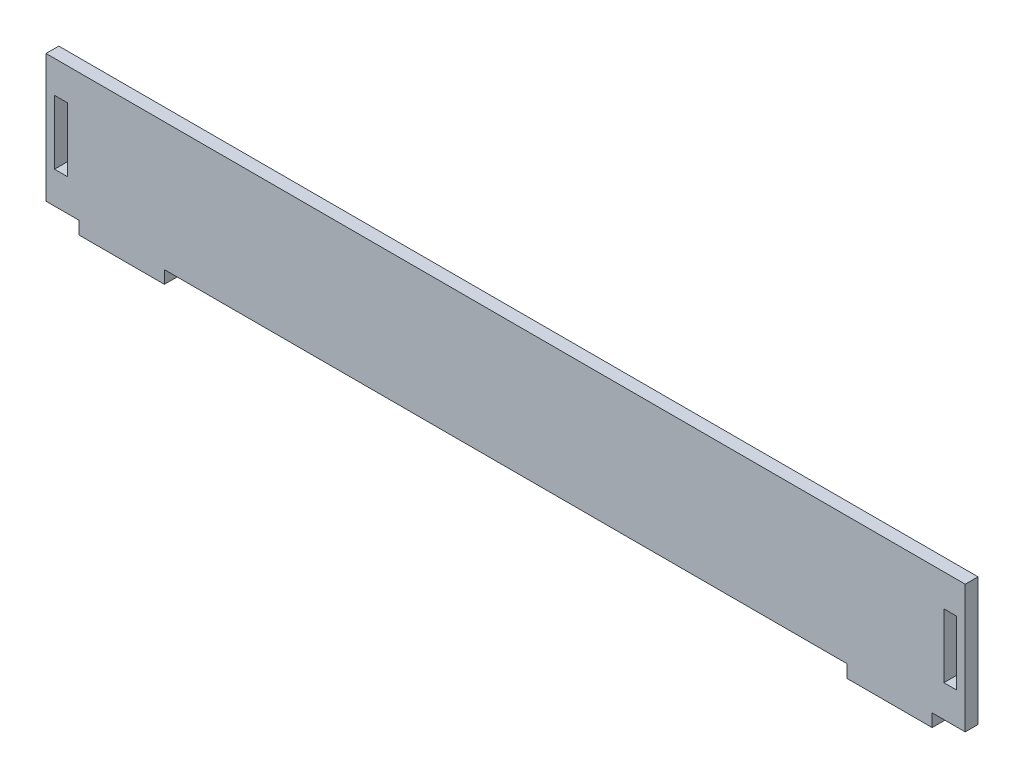
ISO-10303-21;
HEADER;
FILE_DESCRIPTION(('STEP AP214'),'2;1');
FILE_NAME('part.step','',(''),(''),'','','');
FILE_SCHEMA(('AUTOMOTIVE_DESIGN { 1 0 10303 214 1 1 1 1 }'));
ENDSEC;
DATA;
#1=APPLICATION_CONTEXT('core data for automotive mechanical design processes');
#2=APPLICATION_PROTOCOL_DEFINITION('international standard','automotive_design',2000,#1);
#3=PRODUCT_CONTEXT('',#1,'mechanical');
#4=PRODUCT('Part','Part','',(#3));
#5=PRODUCT_RELATED_PRODUCT_CATEGORY('part','',(#4));
#6=PRODUCT_DEFINITION_FORMATION('','',#4);
#7=PRODUCT_DEFINITION_CONTEXT('part definition',#1,'design');
#8=PRODUCT_DEFINITION('design','',#6,#7);
#9=PRODUCT_DEFINITION_SHAPE('','',#8);
#10=(LENGTH_UNIT() NAMED_UNIT(*) SI_UNIT(.MILLI.,.METRE.));
#11=(NAMED_UNIT(*) PLANE_ANGLE_UNIT() SI_UNIT($,.RADIAN.));
#12=(NAMED_UNIT(*) SI_UNIT($,.STERADIAN.) SOLID_ANGLE_UNIT());
#13=UNCERTAINTY_MEASURE_WITH_UNIT(LENGTH_MEASURE(1.E-05),#10,'distance_accuracy_value','');
#14=(GEOMETRIC_REPRESENTATION_CONTEXT(3) GLOBAL_UNCERTAINTY_ASSIGNED_CONTEXT((#13)) GLOBAL_UNIT_ASSIGNED_CONTEXT((#10,
#11,#12)) REPRESENTATION_CONTEXT('',''));
#15=CARTESIAN_POINT('',(0.,0.,0.));
#16=DIRECTION('',(0.,0.,1.));
#17=DIRECTION('',(1.,0.,0.));
#18=AXIS2_PLACEMENT_3D('',#15,#16,#17);
#19=CARTESIAN_POINT('',(-7.75,0.,3.));
#20=DIRECTION('',(1.,0.,0.));
#21=DIRECTION('',(0.,0.,-1.));
#22=AXIS2_PLACEMENT_3D('',#19,#20,#21);
#23=PLANE('',#22);
#24=DIRECTION('',(0.,-1.,0.));
#25=VECTOR('',#24,1.);
#26=CARTESIAN_POINT('',(-7.75,0.,0.));
#27=LINE('',#26,#25);
#28=CARTESIAN_POINT('',(-7.75,30.,0.));
#29=VERTEX_POINT('',#28);
#30=CARTESIAN_POINT('',(-7.75,0.,0.));
#31=VERTEX_POINT('',#30);
#32=EDGE_CURVE('E241',#29,#31,#27,.T.);
#33=ORIENTED_EDGE('',*,*,#32,.T.);
#34=DIRECTION('',(0.,0.,-1.));
#35=VECTOR('',#34,1.);
#36=CARTESIAN_POINT('',(-7.75,0.,3.));
#37=LINE('',#36,#35);
#38=CARTESIAN_POINT('',(-7.75,0.,3.));
#39=VERTEX_POINT('',#38);
#40=EDGE_CURVE('E193',#39,#31,#37,.T.);
#41=ORIENTED_EDGE('',*,*,#40,.F.);
#42=DIRECTION('',(0.,-1.,0.));
#43=VECTOR('',#42,1.);
#44=CARTESIAN_POINT('',(-7.75,0.,3.));
#45=LINE('',#44,#43);
#46=CARTESIAN_POINT('',(-7.75,30.,3.));
#47=VERTEX_POINT('',#46);
#48=EDGE_CURVE('E302',#47,#39,#45,.T.);
#49=ORIENTED_EDGE('',*,*,#48,.F.);
#50=DIRECTION('',(0.,0.,-1.));
#51=VECTOR('',#50,1.);
#52=CARTESIAN_POINT('',(-7.75,30.,3.));
#53=LINE('',#52,#51);
#54=EDGE_CURVE('E155',#47,#29,#53,.T.);
#55=ORIENTED_EDGE('',*,*,#54,.T.);
#56=EDGE_LOOP('',(#33,#41,#49,#55));
#57=FACE_BOUND('',#56,.T.);
#58=ADVANCED_FACE('F75',(#57),#23,.F.);
#59=CARTESIAN_POINT('',(0.,0.,3.));
#60=DIRECTION('',(0.,-1.,0.));
#61=DIRECTION('',(1.,0.,0.));
#62=AXIS2_PLACEMENT_3D('',#59,#60,#61);
#63=PLANE('',#62);
#64=DIRECTION('',(-1.,0.,0.));
#65=VECTOR('',#64,1.);
#66=CARTESIAN_POINT('',(0.,0.,0.));
#67=LINE('',#66,#65);
#68=CARTESIAN_POINT('',(0.,0.,0.));
#69=VERTEX_POINT('',#68);
#70=EDGE_CURVE('E237',#69,#31,#67,.T.);
#71=ORIENTED_EDGE('',*,*,#70,.F.);
#72=DIRECTION('',(0.,0.,-1.));
#73=VECTOR('',#72,1.);
#74=CARTESIAN_POINT('',(0.,0.,3.));
#75=LINE('',#74,#73);
#76=CARTESIAN_POINT('',(0.,0.,3.));
#77=VERTEX_POINT('',#76);
#78=EDGE_CURVE('E197',#77,#69,#75,.T.);
#79=ORIENTED_EDGE('',*,*,#78,.F.);
#80=DIRECTION('',(-1.,0.,0.));
#81=VECTOR('',#80,1.);
#82=CARTESIAN_POINT('',(0.,0.,3.));
#83=LINE('',#82,#81);
#84=EDGE_CURVE('E298',#77,#39,#83,.T.);
#85=ORIENTED_EDGE('',*,*,#84,.T.);
#86=ORIENTED_EDGE('',*,*,#40,.T.);
#87=EDGE_LOOP('',(#71,#79,#85,#86));
#88=FACE_BOUND('',#87,.T.);
#89=ADVANCED_FACE('F457',(#88),#63,.T.);
#90=CARTESIAN_POINT('',(0.,0.,3.));
#91=DIRECTION('',(1.,0.,0.));
#92=DIRECTION('',(0.,0.,-1.));
#93=AXIS2_PLACEMENT_3D('',#90,#91,#92);
#94=PLANE('',#93);
#95=DIRECTION('',(0.,-1.,0.));
#96=VECTOR('',#95,1.);
#97=CARTESIAN_POINT('',(0.,0.,0.));
#98=LINE('',#97,#96);
#99=CARTESIAN_POINT('',(0.,-3.,0.));
#100=VERTEX_POINT('',#99);
#101=EDGE_CURVE('E233',#69,#100,#98,.T.);
#102=ORIENTED_EDGE('',*,*,#101,.T.);
#103=DIRECTION('',(0.,0.,-1.));
#104=VECTOR('',#103,1.);
#105=CARTESIAN_POINT('',(0.,-3.,3.));
#106=LINE('',#105,#104);
#107=CARTESIAN_POINT('',(0.,-3.,3.));
#108=VERTEX_POINT('',#107);
#109=EDGE_CURVE('E201',#108,#100,#106,.T.);
#110=ORIENTED_EDGE('',*,*,#109,.F.);
#111=DIRECTION('',(0.,-1.,0.));
#112=VECTOR('',#111,1.);
#113=CARTESIAN_POINT('',(0.,0.,3.));
#114=LINE('',#113,#112);
#115=EDGE_CURVE('E294',#77,#108,#114,.T.);
#116=ORIENTED_EDGE('',*,*,#115,.F.);
#117=ORIENTED_EDGE('',*,*,#78,.T.);
#118=EDGE_LOOP('',(#102,#110,#116,#117));
#119=FACE_BOUND('',#118,.T.);
#120=ADVANCED_FACE('F454',(#119),#94,.F.);
#121=CARTESIAN_POINT('',(0.,-3.,3.));
#122=DIRECTION('',(0.,1.,0.));
#123=DIRECTION('',(0.,0.,1.));
#124=AXIS2_PLACEMENT_3D('',#121,#122,#123);
#125=PLANE('',#124);
#126=DIRECTION('',(1.,0.,0.));
#127=VECTOR('',#126,1.);
#128=CARTESIAN_POINT('',(0.,-3.,0.));
#129=LINE('',#128,#127);
#130=CARTESIAN_POINT('',(20.,-3.,0.));
#131=VERTEX_POINT('',#130);
#132=EDGE_CURVE('E229',#100,#131,#129,.T.);
#133=ORIENTED_EDGE('',*,*,#132,.T.);
#134=DIRECTION('',(0.,0.,-1.));
#135=VECTOR('',#134,1.);
#136=CARTESIAN_POINT('',(20.,-3.,3.));
#137=LINE('',#136,#135);
#138=CARTESIAN_POINT('',(20.,-3.,3.));
#139=VERTEX_POINT('',#138);
#140=EDGE_CURVE('E205',#139,#131,#137,.T.);
#141=ORIENTED_EDGE('',*,*,#140,.F.);
#142=DIRECTION('',(1.,0.,0.));
#143=VECTOR('',#142,1.);
#144=CARTESIAN_POINT('',(0.,-3.,3.));
#145=LINE('',#144,#143);
#146=EDGE_CURVE('E290',#108,#139,#145,.T.);
#147=ORIENTED_EDGE('',*,*,#146,.F.);
#148=ORIENTED_EDGE('',*,*,#109,.T.);
#149=EDGE_LOOP('',(#133,#141,#147,#148));
#150=FACE_BOUND('',#149,.T.);
#151=ADVANCED_FACE('F449',(#150),#125,.F.);
#152=CARTESIAN_POINT('',(20.,0.,3.));
#153=DIRECTION('',(1.,0.,0.));
#154=DIRECTION('',(0.,0.,-1.));
#155=AXIS2_PLACEMENT_3D('',#152,#153,#154);
#156=PLANE('',#155);
#157=DIRECTION('',(0.,-1.,0.));
#158=VECTOR('',#157,1.);
#159=CARTESIAN_POINT('',(20.,0.,0.));
#160=LINE('',#159,#158);
#161=CARTESIAN_POINT('',(20.,0.,0.));
#162=VERTEX_POINT('',#161);
#163=EDGE_CURVE('E224',#162,#131,#160,.T.);
#164=ORIENTED_EDGE('',*,*,#163,.F.);
#165=DIRECTION('',(0.,0.,-1.));
#166=VECTOR('',#165,1.);
#167=CARTESIAN_POINT('',(20.,0.,3.));
#168=LINE('',#167,#166);
#169=CARTESIAN_POINT('',(20.,0.,3.));
#170=VERTEX_POINT('',#169);
#171=EDGE_CURVE('E209',#170,#162,#168,.T.);
#172=ORIENTED_EDGE('',*,*,#171,.F.);
#173=DIRECTION('',(0.,-1.,0.));
#174=VECTOR('',#173,1.);
#175=CARTESIAN_POINT('',(20.,0.,3.));
#176=LINE('',#175,#174);
#177=EDGE_CURVE('E285',#170,#139,#176,.T.);
#178=ORIENTED_EDGE('',*,*,#177,.T.);
#179=ORIENTED_EDGE('',*,*,#140,.T.);
#180=EDGE_LOOP('',(#164,#172,#178,#179));
#181=FACE_BOUND('',#180,.T.);
#182=ADVANCED_FACE('F443',(#181),#156,.T.);
#183=CARTESIAN_POINT('',(180.,3.90833199137575E-13,0.));
#184=VERTEX_POINT('',#183);
#185=EDGE_CURVE('E228',#184,#162,#67,.T.);
#186=ORIENTED_EDGE('',*,*,#185,.F.);
#187=DIRECTION('',(0.,0.,1.));
#188=VECTOR('',#187,1.);
#189=CARTESIAN_POINT('',(180.,3.90833199137575E-13,3.));
#190=LINE('',#189,#188);
#191=CARTESIAN_POINT('',(180.,3.90833199137575E-13,3.));
#192=VERTEX_POINT('',#191);
#193=EDGE_CURVE('E12',#184,#192,#190,.T.);
#194=ORIENTED_EDGE('',*,*,#193,.T.);
#195=EDGE_CURVE('E289',#192,#170,#83,.T.);
#196=ORIENTED_EDGE('',*,*,#195,.T.);
#197=ORIENTED_EDGE('',*,*,#171,.T.);
#198=EDGE_LOOP('',(#186,#194,#196,#197));
#199=FACE_BOUND('',#198,.T.);
#200=ADVANCED_FACE('F435',(#199),#63,.T.);
#201=DIRECTION('',(0.,0.,1.));
#202=VECTOR('',#201,1.);
#203=CARTESIAN_POINT('',(200.,4.32466562561018E-13,3.));
#204=LINE('',#203,#202);
#205=CARTESIAN_POINT('',(200.,4.32466562561018E-13,0.));
#206=VERTEX_POINT('',#205);
#207=CARTESIAN_POINT('',(200.,4.32466562561018E-13,3.));
#208=VERTEX_POINT('',#207);
#209=EDGE_CURVE('E86',#206,#208,#204,.T.);
#210=ORIENTED_EDGE('',*,*,#209,.F.);
#211=CARTESIAN_POINT('',(207.75,0.,0.));
#212=VERTEX_POINT('',#211);
#213=EDGE_CURVE('E139',#212,#206,#67,.T.);
#214=ORIENTED_EDGE('',*,*,#213,.F.);
#215=DIRECTION('',(0.,0.,-1.));
#216=VECTOR('',#215,1.);
#217=CARTESIAN_POINT('',(207.75,0.,3.));
#218=LINE('',#217,#216);
#219=CARTESIAN_POINT('',(207.75,0.,3.));
#220=VERTEX_POINT('',#219);
#221=EDGE_CURVE('E213',#220,#212,#218,.T.);
#222=ORIENTED_EDGE('',*,*,#221,.F.);
#223=EDGE_CURVE('E284',#220,#208,#83,.T.);
#224=ORIENTED_EDGE('',*,*,#223,.T.);
#225=EDGE_LOOP('',(#210,#214,#222,#224));
#226=FACE_BOUND('',#225,.T.);
#227=ADVANCED_FACE('F471',(#226),#63,.T.);
#228=CARTESIAN_POINT('',(207.75,0.,3.));
#229=DIRECTION('',(1.,0.,0.));
#230=DIRECTION('',(0.,0.,-1.));
#231=AXIS2_PLACEMENT_3D('',#228,#229,#230);
#232=PLANE('',#231);
#233=DIRECTION('',(0.,-1.,0.));
#234=VECTOR('',#233,1.);
#235=CARTESIAN_POINT('',(207.75,0.,0.));
#236=LINE('',#235,#234);
#237=CARTESIAN_POINT('',(207.75,30.,0.));
#238=VERTEX_POINT('',#237);
#239=EDGE_CURVE('E220',#238,#212,#236,.T.);
#240=ORIENTED_EDGE('',*,*,#239,.F.);
#241=DIRECTION('',(0.,0.,-1.));
#242=VECTOR('',#241,1.);
#243=CARTESIAN_POINT('',(207.75,30.,3.));
#244=LINE('',#243,#242);
#245=CARTESIAN_POINT('',(207.75,30.,3.));
#246=VERTEX_POINT('',#245);
#247=EDGE_CURVE('E178',#246,#238,#244,.T.);
#248=ORIENTED_EDGE('',*,*,#247,.F.);
#249=DIRECTION('',(0.,-1.,0.));
#250=VECTOR('',#249,1.);
#251=CARTESIAN_POINT('',(207.75,0.,3.));
#252=LINE('',#251,#250);
#253=EDGE_CURVE('E173',#246,#220,#252,.T.);
#254=ORIENTED_EDGE('',*,*,#253,.T.);
#255=ORIENTED_EDGE('',*,*,#221,.T.);
#256=EDGE_LOOP('',(#240,#248,#254,#255));
#257=FACE_BOUND('',#256,.T.);
#258=ADVANCED_FACE('F467',(#257),#232,.T.);
#259=CARTESIAN_POINT('',(0.,30.,3.));
#260=DIRECTION('',(0.,-1.,0.));
#261=DIRECTION('',(0.,0.,-1.));
#262=AXIS2_PLACEMENT_3D('',#259,#260,#261);
#263=PLANE('',#262);
#264=DIRECTION('',(-1.,0.,0.));
#265=VECTOR('',#264,1.);
#266=CARTESIAN_POINT('',(0.,30.,0.));
#267=LINE('',#266,#265);
#268=EDGE_CURVE('E245',#238,#29,#267,.T.);
#269=ORIENTED_EDGE('',*,*,#268,.T.);
#270=ORIENTED_EDGE('',*,*,#54,.F.);
#271=DIRECTION('',(-1.,0.,0.));
#272=VECTOR('',#271,1.);
#273=CARTESIAN_POINT('',(0.,30.,3.));
#274=LINE('',#273,#272);
#275=EDGE_CURVE('E306',#246,#47,#274,.T.);
#276=ORIENTED_EDGE('',*,*,#275,.F.);
#277=ORIENTED_EDGE('',*,*,#247,.T.);
#278=EDGE_LOOP('',(#269,#270,#276,#277));
#279=FACE_BOUND('',#278,.T.);
#280=ADVANCED_FACE('F464',(#279),#263,.F.);
#281=CARTESIAN_POINT('',(0.,7.49999999999994,3.));
#282=DIRECTION('',(0.,-1.,0.));
#283=DIRECTION('',(1.,0.,0.));
#284=AXIS2_PLACEMENT_3D('',#281,#282,#283);
#285=PLANE('',#284);
#286=DIRECTION('',(-1.,0.,0.));
#287=VECTOR('',#286,1.);
#288=CARTESIAN_POINT('',(0.,7.49999999999994,0.));
#289=LINE('',#288,#287);
#290=CARTESIAN_POINT('',(205.75,7.5,0.));
#291=VERTEX_POINT('',#290);
#292=CARTESIAN_POINT('',(202.75,7.5,0.));
#293=VERTEX_POINT('',#292);
#294=EDGE_CURVE('E257',#291,#293,#289,.T.);
#295=ORIENTED_EDGE('',*,*,#294,.T.);
#296=DIRECTION('',(0.,0.,-1.));
#297=VECTOR('',#296,1.);
#298=CARTESIAN_POINT('',(202.75,7.5,3.));
#299=LINE('',#298,#297);
#300=CARTESIAN_POINT('',(202.75,7.5,3.));
#301=VERTEX_POINT('',#300);
#302=EDGE_CURVE('E179',#301,#293,#299,.T.);
#303=ORIENTED_EDGE('',*,*,#302,.F.);
#304=DIRECTION('',(-1.,0.,0.));
#305=VECTOR('',#304,1.);
#306=CARTESIAN_POINT('',(0.,7.49999999999994,3.));
#307=LINE('',#306,#305);
#308=CARTESIAN_POINT('',(205.75,7.5,3.));
#309=VERTEX_POINT('',#308);
#310=EDGE_CURVE('E318',#309,#301,#307,.T.);
#311=ORIENTED_EDGE('',*,*,#310,.F.);
#312=DIRECTION('',(0.,0.,-1.));
#313=VECTOR('',#312,1.);
#314=CARTESIAN_POINT('',(205.75,7.5,3.));
#315=LINE('',#314,#313);
#316=EDGE_CURVE('E174',#309,#291,#315,.T.);
#317=ORIENTED_EDGE('',*,*,#316,.T.);
#318=EDGE_LOOP('',(#295,#303,#311,#317));
#319=FACE_BOUND('',#318,.T.);
#320=ADVANCED_FACE('F494',(#319),#285,.F.);
#321=CARTESIAN_POINT('',(202.75,0.,3.));
#322=DIRECTION('',(1.,0.,0.));
#323=DIRECTION('',(0.,0.,-1.));
#324=AXIS2_PLACEMENT_3D('',#321,#322,#323);
#325=PLANE('',#324);
#326=DIRECTION('',(0.,-1.,0.));
#327=VECTOR('',#326,1.);
#328=CARTESIAN_POINT('',(202.75,0.,0.));
#329=LINE('',#328,#327);
#330=CARTESIAN_POINT('',(202.75,22.5,0.));
#331=VERTEX_POINT('',#330);
#332=EDGE_CURVE('E253',#331,#293,#329,.T.);
#333=ORIENTED_EDGE('',*,*,#332,.F.);
#334=DIRECTION('',(0.,0.,-1.));
#335=VECTOR('',#334,1.);
#336=CARTESIAN_POINT('',(202.75,22.5,3.));
#337=LINE('',#336,#335);
#338=CARTESIAN_POINT('',(202.75,22.5,3.));
#339=VERTEX_POINT('',#338);
#340=EDGE_CURVE('E183',#339,#331,#337,.T.);
#341=ORIENTED_EDGE('',*,*,#340,.F.);
#342=DIRECTION('',(0.,-1.,0.));
#343=VECTOR('',#342,1.);
#344=CARTESIAN_POINT('',(202.75,0.,3.));
#345=LINE('',#344,#343);
#346=EDGE_CURVE('E314',#339,#301,#345,.T.);
#347=ORIENTED_EDGE('',*,*,#346,.T.);
#348=ORIENTED_EDGE('',*,*,#302,.T.);
#349=EDGE_LOOP('',(#333,#341,#347,#348));
#350=FACE_BOUND('',#349,.T.);
#351=ADVANCED_FACE('F499',(#350),#325,.T.);
#352=CARTESIAN_POINT('',(0.,22.5,3.));
#353=DIRECTION('',(0.,1.,0.));
#354=DIRECTION('',(0.,0.,1.));
#355=AXIS2_PLACEMENT_3D('',#352,#353,#354);
#356=PLANE('',#355);
#357=DIRECTION('',(1.,0.,0.));
#358=VECTOR('',#357,1.);
#359=CARTESIAN_POINT('',(0.,22.5,0.));
#360=LINE('',#359,#358);
#361=CARTESIAN_POINT('',(205.75,22.5,0.));
#362=VERTEX_POINT('',#361);
#363=EDGE_CURVE('E249',#331,#362,#360,.T.);
#364=ORIENTED_EDGE('',*,*,#363,.T.);
#365=DIRECTION('',(0.,0.,-1.));
#366=VECTOR('',#365,1.);
#367=CARTESIAN_POINT('',(205.75,22.5,3.));
#368=LINE('',#367,#366);
#369=CARTESIAN_POINT('',(205.75,22.5,3.));
#370=VERTEX_POINT('',#369);
#371=EDGE_CURVE('E160',#370,#362,#368,.T.);
#372=ORIENTED_EDGE('',*,*,#371,.F.);
#373=DIRECTION('',(1.,0.,0.));
#374=VECTOR('',#373,1.);
#375=CARTESIAN_POINT('',(0.,22.5,3.));
#376=LINE('',#375,#374);
#377=EDGE_CURVE('E310',#339,#370,#376,.T.);
#378=ORIENTED_EDGE('',*,*,#377,.F.);
#379=ORIENTED_EDGE('',*,*,#340,.T.);
#380=EDGE_LOOP('',(#364,#372,#378,#379));
#381=FACE_BOUND('',#380,.T.);
#382=ADVANCED_FACE('F495',(#381),#356,.F.);
#383=CARTESIAN_POINT('',(205.75,0.,3.));
#384=DIRECTION('',(1.,0.,0.));
#385=DIRECTION('',(0.,0.,-1.));
#386=AXIS2_PLACEMENT_3D('',#383,#384,#385);
#387=PLANE('',#386);
#388=DIRECTION('',(0.,-1.,0.));
#389=VECTOR('',#388,1.);
#390=CARTESIAN_POINT('',(205.75,0.,0.));
#391=LINE('',#390,#389);
#392=EDGE_CURVE('E261',#362,#291,#391,.T.);
#393=ORIENTED_EDGE('',*,*,#392,.T.);
#394=ORIENTED_EDGE('',*,*,#316,.F.);
#395=DIRECTION('',(0.,-1.,0.));
#396=VECTOR('',#395,1.);
#397=CARTESIAN_POINT('',(205.75,0.,3.));
#398=LINE('',#397,#396);
#399=EDGE_CURVE('E322',#370,#309,#398,.T.);
#400=ORIENTED_EDGE('',*,*,#399,.F.);
#401=ORIENTED_EDGE('',*,*,#371,.T.);
#402=EDGE_LOOP('',(#393,#394,#400,#401));
#403=FACE_BOUND('',#402,.T.);
#404=ADVANCED_FACE('F498',(#403),#387,.F.);
#405=CARTESIAN_POINT('',(-5.75,0.,3.));
#406=DIRECTION('',(1.,0.,0.));
#407=DIRECTION('',(0.,0.,-1.));
#408=AXIS2_PLACEMENT_3D('',#405,#406,#407);
#409=PLANE('',#408);
#410=DIRECTION('',(0.,-1.,0.));
#411=VECTOR('',#410,1.);
#412=CARTESIAN_POINT('',(-5.75,0.,0.));
#413=LINE('',#412,#411);
#414=CARTESIAN_POINT('',(-5.75,22.5,0.));
#415=VERTEX_POINT('',#414);
#416=CARTESIAN_POINT('',(-5.75,7.5,0.));
#417=VERTEX_POINT('',#416);
#418=EDGE_CURVE('E273',#415,#417,#413,.T.);
#419=ORIENTED_EDGE('',*,*,#418,.F.);
#420=DIRECTION('',(0.,0.,-1.));
#421=VECTOR('',#420,1.);
#422=CARTESIAN_POINT('',(-5.75,22.5,3.));
#423=LINE('',#422,#421);
#424=CARTESIAN_POINT('',(-5.75,22.5,3.));
#425=VERTEX_POINT('',#424);
#426=EDGE_CURVE('E161',#425,#415,#423,.T.);
#427=ORIENTED_EDGE('',*,*,#426,.F.);
#428=DIRECTION('',(0.,-1.,0.));
#429=VECTOR('',#428,1.);
#430=CARTESIAN_POINT('',(-5.75,0.,3.));
#431=LINE('',#430,#429);
#432=CARTESIAN_POINT('',(-5.75,7.5,3.));
#433=VERTEX_POINT('',#432);
#434=EDGE_CURVE('E334',#425,#433,#431,.T.);
#435=ORIENTED_EDGE('',*,*,#434,.T.);
#436=DIRECTION('',(0.,0.,-1.));
#437=VECTOR('',#436,1.);
#438=CARTESIAN_POINT('',(-5.75,7.5,3.));
#439=LINE('',#438,#437);
#440=EDGE_CURVE('E156',#433,#417,#439,.T.);
#441=ORIENTED_EDGE('',*,*,#440,.T.);
#442=EDGE_LOOP('',(#419,#427,#435,#441));
#443=FACE_BOUND('',#442,.T.);
#444=ADVANCED_FACE('F509',(#443),#409,.T.);
#445=CARTESIAN_POINT('',(0.,22.5,3.));
#446=DIRECTION('',(0.,-1.,0.));
#447=DIRECTION('',(0.,0.,-1.));
#448=AXIS2_PLACEMENT_3D('',#445,#446,#447);
#449=PLANE('',#448);
#450=DIRECTION('',(-1.,0.,0.));
#451=VECTOR('',#450,1.);
#452=CARTESIAN_POINT('',(0.,22.5,0.));
#453=LINE('',#452,#451);
#454=CARTESIAN_POINT('',(-2.75,22.5,0.));
#455=VERTEX_POINT('',#454);
#456=EDGE_CURVE('E269',#455,#415,#453,.T.);
#457=ORIENTED_EDGE('',*,*,#456,.F.);
#458=DIRECTION('',(0.,0.,-1.));
#459=VECTOR('',#458,1.);
#460=CARTESIAN_POINT('',(-2.75,22.5,3.));
#461=LINE('',#460,#459);
#462=CARTESIAN_POINT('',(-2.75,22.5,3.));
#463=VERTEX_POINT('',#462);
#464=EDGE_CURVE('E165',#463,#455,#461,.T.);
#465=ORIENTED_EDGE('',*,*,#464,.F.);
#466=DIRECTION('',(-1.,0.,0.));
#467=VECTOR('',#466,1.);
#468=CARTESIAN_POINT('',(0.,22.5,3.));
#469=LINE('',#468,#467);
#470=EDGE_CURVE('E330',#463,#425,#469,.T.);
#471=ORIENTED_EDGE('',*,*,#470,.T.);
#472=ORIENTED_EDGE('',*,*,#426,.T.);
#473=EDGE_LOOP('',(#457,#465,#471,#472));
#474=FACE_BOUND('',#473,.T.);
#475=ADVANCED_FACE('F513',(#474),#449,.T.);
#476=CARTESIAN_POINT('',(-2.75,0.,3.));
#477=DIRECTION('',(-1.,0.,0.));
#478=DIRECTION('',(0.,0.,1.));
#479=AXIS2_PLACEMENT_3D('',#476,#477,#478);
#480=PLANE('',#479);
#481=DIRECTION('',(0.,1.,0.));
#482=VECTOR('',#481,1.);
#483=CARTESIAN_POINT('',(-2.75,0.,0.));
#484=LINE('',#483,#482);
#485=CARTESIAN_POINT('',(-2.75,7.5,0.));
#486=VERTEX_POINT('',#485);
#487=EDGE_CURVE('E265',#486,#455,#484,.T.);
#488=ORIENTED_EDGE('',*,*,#487,.F.);
#489=DIRECTION('',(0.,0.,-1.));
#490=VECTOR('',#489,1.);
#491=CARTESIAN_POINT('',(-2.75,7.5,3.));
#492=LINE('',#491,#490);
#493=CARTESIAN_POINT('',(-2.75,7.5,3.));
#494=VERTEX_POINT('',#493);
#495=EDGE_CURVE('E169',#494,#486,#492,.T.);
#496=ORIENTED_EDGE('',*,*,#495,.F.);
#497=DIRECTION('',(0.,1.,0.));
#498=VECTOR('',#497,1.);
#499=CARTESIAN_POINT('',(-2.75,0.,3.));
#500=LINE('',#499,#498);
#501=EDGE_CURVE('E326',#494,#463,#500,.T.);
#502=ORIENTED_EDGE('',*,*,#501,.T.);
#503=ORIENTED_EDGE('',*,*,#464,.T.);
#504=EDGE_LOOP('',(#488,#496,#502,#503));
#505=FACE_BOUND('',#504,.T.);
#506=ADVANCED_FACE('F360',(#505),#480,.T.);
#507=CARTESIAN_POINT('',(0.,7.50000000000001,3.));
#508=DIRECTION('',(0.,1.,0.));
#509=DIRECTION('',(-1.,0.,0.));
#510=AXIS2_PLACEMENT_3D('',#507,#508,#509);
#511=PLANE('',#510);
#512=DIRECTION('',(1.,0.,0.));
#513=VECTOR('',#512,1.);
#514=CARTESIAN_POINT('',(0.,7.50000000000001,0.));
#515=LINE('',#514,#513);
#516=EDGE_CURVE('E277',#417,#486,#515,.T.);
#517=ORIENTED_EDGE('',*,*,#516,.F.);
#518=ORIENTED_EDGE('',*,*,#440,.F.);
#519=DIRECTION('',(1.,0.,0.));
#520=VECTOR('',#519,1.);
#521=CARTESIAN_POINT('',(0.,7.50000000000001,3.));
#522=LINE('',#521,#520);
#523=EDGE_CURVE('E223',#433,#494,#522,.T.);
#524=ORIENTED_EDGE('',*,*,#523,.T.);
#525=ORIENTED_EDGE('',*,*,#495,.T.);
#526=EDGE_LOOP('',(#517,#518,#524,#525));
#527=FACE_BOUND('',#526,.T.);
#528=ADVANCED_FACE('F346',(#527),#511,.T.);
#529=CARTESIAN_POINT('',(0.,0.,0.));
#530=DIRECTION('',(0.,0.,1.));
#531=DIRECTION('',(1.,0.,0.));
#532=AXIS2_PLACEMENT_3D('',#529,#530,#531);
#533=PLANE('',#532);
#534=ORIENTED_EDGE('',*,*,#516,.T.);
#535=ORIENTED_EDGE('',*,*,#487,.T.);
#536=ORIENTED_EDGE('',*,*,#456,.T.);
#537=ORIENTED_EDGE('',*,*,#418,.T.);
#538=EDGE_LOOP('',(#534,#535,#536,#537));
#539=FACE_BOUND('',#538,.T.);
#540=ORIENTED_EDGE('',*,*,#392,.F.);
#541=ORIENTED_EDGE('',*,*,#363,.F.);
#542=ORIENTED_EDGE('',*,*,#332,.T.);
#543=ORIENTED_EDGE('',*,*,#294,.F.);
#544=EDGE_LOOP('',(#540,#541,#542,#543));
#545=FACE_BOUND('',#544,.T.);
#546=ORIENTED_EDGE('',*,*,#268,.F.);
#547=ORIENTED_EDGE('',*,*,#239,.T.);
#548=ORIENTED_EDGE('',*,*,#213,.T.);
#549=DIRECTION('',(0.,-1.,0.));
#550=VECTOR('',#549,1.);
#551=CARTESIAN_POINT('',(200.,0.,0.));
#552=LINE('',#551,#550);
#553=CARTESIAN_POINT('',(200.,-3.,0.));
#554=VERTEX_POINT('',#553);
#555=EDGE_CURVE('E121',#206,#554,#552,.T.);
#556=ORIENTED_EDGE('',*,*,#555,.T.);
#557=DIRECTION('',(-1.,0.,0.));
#558=VECTOR('',#557,1.);
#559=CARTESIAN_POINT('',(200.,-3.,0.));
#560=LINE('',#559,#558);
#561=CARTESIAN_POINT('',(180.,-3.,0.));
#562=VERTEX_POINT('',#561);
#563=EDGE_CURVE('E128',#554,#562,#560,.T.);
#564=ORIENTED_EDGE('',*,*,#563,.T.);
#565=DIRECTION('',(0.,-1.,0.));
#566=VECTOR('',#565,1.);
#567=CARTESIAN_POINT('',(180.,0.,0.));
#568=LINE('',#567,#566);
#569=EDGE_CURVE('E133',#184,#562,#568,.T.);
#570=ORIENTED_EDGE('',*,*,#569,.F.);
#571=ORIENTED_EDGE('',*,*,#185,.T.);
#572=ORIENTED_EDGE('',*,*,#163,.T.);
#573=ORIENTED_EDGE('',*,*,#132,.F.);
#574=ORIENTED_EDGE('',*,*,#101,.F.);
#575=ORIENTED_EDGE('',*,*,#70,.T.);
#576=ORIENTED_EDGE('',*,*,#32,.F.);
#577=EDGE_LOOP('',(#546,#547,#548,#556,#564,#570,#571,#572,#573,#574,#575,#576));
#578=FACE_BOUND('',#577,.T.);
#579=ADVANCED_FACE('F136',(#539,#545,#578),#533,.F.);
#580=CARTESIAN_POINT('',(0.,0.,3.));
#581=DIRECTION('',(0.,0.,1.));
#582=DIRECTION('',(1.,0.,0.));
#583=AXIS2_PLACEMENT_3D('',#580,#581,#582);
#584=PLANE('',#583);
#585=ORIENTED_EDGE('',*,*,#523,.F.);
#586=ORIENTED_EDGE('',*,*,#434,.F.);
#587=ORIENTED_EDGE('',*,*,#470,.F.);
#588=ORIENTED_EDGE('',*,*,#501,.F.);
#589=EDGE_LOOP('',(#585,#586,#587,#588));
#590=FACE_BOUND('',#589,.T.);
#591=ORIENTED_EDGE('',*,*,#399,.T.);
#592=ORIENTED_EDGE('',*,*,#310,.T.);
#593=ORIENTED_EDGE('',*,*,#346,.F.);
#594=ORIENTED_EDGE('',*,*,#377,.T.);
#595=EDGE_LOOP('',(#591,#592,#593,#594));
#596=FACE_BOUND('',#595,.T.);
#597=ORIENTED_EDGE('',*,*,#275,.T.);
#598=ORIENTED_EDGE('',*,*,#48,.T.);
#599=ORIENTED_EDGE('',*,*,#84,.F.);
#600=ORIENTED_EDGE('',*,*,#115,.T.);
#601=ORIENTED_EDGE('',*,*,#146,.T.);
#602=ORIENTED_EDGE('',*,*,#177,.F.);
#603=ORIENTED_EDGE('',*,*,#195,.F.);
#604=DIRECTION('',(0.,-1.,0.));
#605=VECTOR('',#604,1.);
#606=CARTESIAN_POINT('',(180.,0.,3.));
#607=LINE('',#606,#605);
#608=CARTESIAN_POINT('',(180.,-3.,3.));
#609=VERTEX_POINT('',#608);
#610=EDGE_CURVE('E141',#192,#609,#607,.T.);
#611=ORIENTED_EDGE('',*,*,#610,.T.);
#612=DIRECTION('',(-1.,0.,0.));
#613=VECTOR('',#612,1.);
#614=CARTESIAN_POINT('',(200.,-3.,3.));
#615=LINE('',#614,#613);
#616=CARTESIAN_POINT('',(200.,-3.,3.));
#617=VERTEX_POINT('',#616);
#618=EDGE_CURVE('E144',#617,#609,#615,.T.);
#619=ORIENTED_EDGE('',*,*,#618,.F.);
#620=DIRECTION('',(0.,-1.,0.));
#621=VECTOR('',#620,1.);
#622=CARTESIAN_POINT('',(200.,0.,3.));
#623=LINE('',#622,#621);
#624=EDGE_CURVE('E124',#208,#617,#623,.T.);
#625=ORIENTED_EDGE('',*,*,#624,.F.);
#626=ORIENTED_EDGE('',*,*,#223,.F.);
#627=ORIENTED_EDGE('',*,*,#253,.F.);
#628=EDGE_LOOP('',(#597,#598,#599,#600,#601,#602,#603,#611,#619,#625,#626,#627));
#629=FACE_BOUND('',#628,.T.);
#630=ADVANCED_FACE('F356',(#590,#596,#629),#584,.T.);
#631=CARTESIAN_POINT('',(180.,0.,3.));
#632=DIRECTION('',(1.,0.,0.));
#633=DIRECTION('',(0.,0.,-1.));
#634=AXIS2_PLACEMENT_3D('',#631,#632,#633);
#635=PLANE('',#634);
#636=ORIENTED_EDGE('',*,*,#569,.T.);
#637=DIRECTION('',(0.,0.,-1.));
#638=VECTOR('',#637,1.);
#639=CARTESIAN_POINT('',(180.,-3.,3.));
#640=LINE('',#639,#638);
#641=EDGE_CURVE('E79',#609,#562,#640,.T.);
#642=ORIENTED_EDGE('',*,*,#641,.F.);
#643=ORIENTED_EDGE('',*,*,#610,.F.);
#644=ORIENTED_EDGE('',*,*,#193,.F.);
#645=EDGE_LOOP('',(#636,#642,#643,#644));
#646=FACE_BOUND('',#645,.T.);
#647=ADVANCED_FACE('F77',(#646),#635,.F.);
#648=CARTESIAN_POINT('',(200.,-3.,3.));
#649=DIRECTION('',(0.,-1.,0.));
#650=DIRECTION('',(0.,0.,-1.));
#651=AXIS2_PLACEMENT_3D('',#648,#649,#650);
#652=PLANE('',#651);
#653=ORIENTED_EDGE('',*,*,#563,.F.);
#654=DIRECTION('',(0.,0.,-1.));
#655=VECTOR('',#654,1.);
#656=CARTESIAN_POINT('',(200.,-3.,3.));
#657=LINE('',#656,#655);
#658=EDGE_CURVE('E117',#617,#554,#657,.T.);
#659=ORIENTED_EDGE('',*,*,#658,.F.);
#660=ORIENTED_EDGE('',*,*,#618,.T.);
#661=ORIENTED_EDGE('',*,*,#641,.T.);
#662=EDGE_LOOP('',(#653,#659,#660,#661));
#663=FACE_BOUND('',#662,.T.);
#664=ADVANCED_FACE('F129',(#663),#652,.T.);
#665=CARTESIAN_POINT('',(200.,0.,3.));
#666=DIRECTION('',(1.,0.,0.));
#667=DIRECTION('',(0.,0.,-1.));
#668=AXIS2_PLACEMENT_3D('',#665,#666,#667);
#669=PLANE('',#668);
#670=ORIENTED_EDGE('',*,*,#555,.F.);
#671=ORIENTED_EDGE('',*,*,#209,.T.);
#672=ORIENTED_EDGE('',*,*,#624,.T.);
#673=ORIENTED_EDGE('',*,*,#658,.T.);
#674=EDGE_LOOP('',(#670,#671,#672,#673));
#675=FACE_BOUND('',#674,.T.);
#676=ADVANCED_FACE('F118',(#675),#669,.T.);
#677=CLOSED_SHELL('',(#58,#89,#120,#151,#182,#200,#227,#258,#280,#320,#351,#382,#404,#444,#475,
#506,#528,#579,#630,#647,#664,#676));
#678=MANIFOLD_SOLID_BREP('B2',#677);
#679=ADVANCED_BREP_SHAPE_REPRESENTATION('',(#18,#678),#14);
#680=SHAPE_DEFINITION_REPRESENTATION(#9,#679);
ENDSEC;
END-ISO-10303-21;
